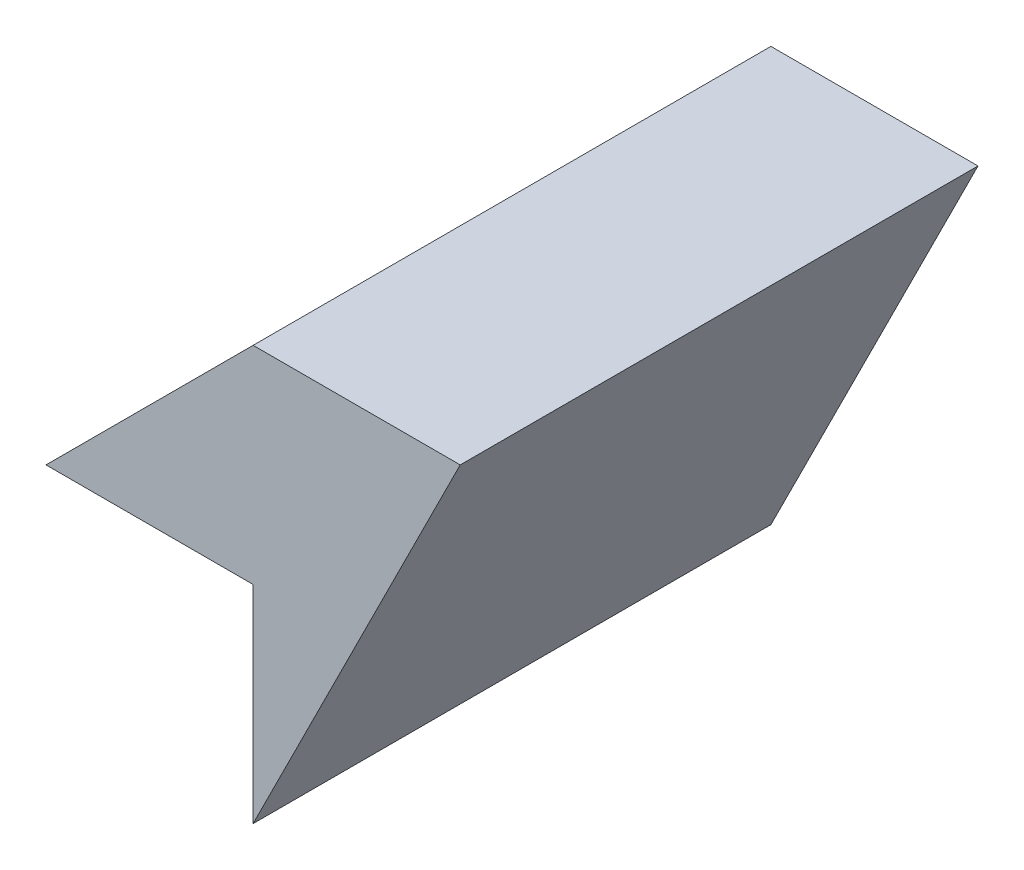
ISO-10303-21;
HEADER;
FILE_DESCRIPTION(('STEP AP214'),'2;1');
FILE_NAME('part.step','',(''),(''),'','','');
FILE_SCHEMA(('AUTOMOTIVE_DESIGN { 1 0 10303 214 1 1 1 1 }'));
ENDSEC;
DATA;
#1=APPLICATION_CONTEXT('core data for automotive mechanical design processes');
#2=APPLICATION_PROTOCOL_DEFINITION('international standard','automotive_design',2000,#1);
#3=PRODUCT_CONTEXT('',#1,'mechanical');
#4=PRODUCT('Part','Part','',(#3));
#5=PRODUCT_RELATED_PRODUCT_CATEGORY('part','',(#4));
#6=PRODUCT_DEFINITION_FORMATION('','',#4);
#7=PRODUCT_DEFINITION_CONTEXT('part definition',#1,'design');
#8=PRODUCT_DEFINITION('design','',#6,#7);
#9=PRODUCT_DEFINITION_SHAPE('','',#8);
#10=(LENGTH_UNIT() NAMED_UNIT(*) SI_UNIT(.MILLI.,.METRE.));
#11=(NAMED_UNIT(*) PLANE_ANGLE_UNIT() SI_UNIT($,.RADIAN.));
#12=(NAMED_UNIT(*) SI_UNIT($,.STERADIAN.) SOLID_ANGLE_UNIT());
#13=UNCERTAINTY_MEASURE_WITH_UNIT(LENGTH_MEASURE(1.E-05),#10,'distance_accuracy_value','');
#14=(GEOMETRIC_REPRESENTATION_CONTEXT(3) GLOBAL_UNCERTAINTY_ASSIGNED_CONTEXT((#13)) GLOBAL_UNIT_ASSIGNED_CONTEXT((#10,
#11,#12)) REPRESENTATION_CONTEXT('',''));
#15=CARTESIAN_POINT('',(0.,0.,0.));
#16=DIRECTION('',(0.,0.,1.));
#17=DIRECTION('',(1.,0.,0.));
#18=AXIS2_PLACEMENT_3D('',#15,#16,#17);
#19=CARTESIAN_POINT('',(-10.,-10.,25.));
#20=DIRECTION('',(0.,1.,0.));
#21=DIRECTION('',(-1.,0.,0.));
#22=AXIS2_PLACEMENT_3D('',#19,#20,#21);
#23=PLANE('',#22);
#24=DIRECTION('',(1.,0.,0.));
#25=VECTOR('',#24,1.);
#26=CARTESIAN_POINT('',(-10.,-10.,0.));
#27=LINE('',#26,#25);
#28=CARTESIAN_POINT('',(-20.,-10.,0.));
#29=VERTEX_POINT('',#28);
#30=CARTESIAN_POINT('',(-10.,-10.,0.));
#31=VERTEX_POINT('',#30);
#32=EDGE_CURVE('E107',#29,#31,#27,.T.);
#33=ORIENTED_EDGE('',*,*,#32,.T.);
#34=DIRECTION('',(0.,0.,-1.));
#35=VECTOR('',#34,1.);
#36=CARTESIAN_POINT('',(-10.,-10.,25.));
#37=LINE('',#36,#35);
#38=CARTESIAN_POINT('',(-10.,-10.,25.));
#39=VERTEX_POINT('',#38);
#40=EDGE_CURVE('E11',#39,#31,#37,.T.);
#41=ORIENTED_EDGE('',*,*,#40,.F.);
#42=DIRECTION('',(1.,0.,0.));
#43=VECTOR('',#42,1.);
#44=CARTESIAN_POINT('',(-10.,-10.,25.));
#45=LINE('',#44,#43);
#46=CARTESIAN_POINT('',(-20.,-10.,25.));
#47=VERTEX_POINT('',#46);
#48=EDGE_CURVE('E115',#47,#39,#45,.T.);
#49=ORIENTED_EDGE('',*,*,#48,.F.);
#50=DIRECTION('',(0.,0.,-1.));
#51=VECTOR('',#50,1.);
#52=CARTESIAN_POINT('',(-20.,-10.,25.));
#53=LINE('',#52,#51);
#54=EDGE_CURVE('E103',#47,#29,#53,.T.);
#55=ORIENTED_EDGE('',*,*,#54,.T.);
#56=EDGE_LOOP('',(#33,#41,#49,#55));
#57=FACE_BOUND('',#56,.T.);
#58=ADVANCED_FACE('F33',(#57),#23,.F.);
#59=CARTESIAN_POINT('',(-10.,-20.,25.));
#60=DIRECTION('',(1.,0.,0.));
#61=DIRECTION('',(0.,0.,-1.));
#62=AXIS2_PLACEMENT_3D('',#59,#60,#61);
#63=PLANE('',#62);
#64=DIRECTION('',(0.,-1.,0.));
#65=VECTOR('',#64,1.);
#66=CARTESIAN_POINT('',(-10.,-20.,0.));
#67=LINE('',#66,#65);
#68=CARTESIAN_POINT('',(-10.,-20.,0.));
#69=VERTEX_POINT('',#68);
#70=EDGE_CURVE('E110',#31,#69,#67,.T.);
#71=ORIENTED_EDGE('',*,*,#70,.T.);
#72=DIRECTION('',(0.,0.,-1.));
#73=VECTOR('',#72,1.);
#74=CARTESIAN_POINT('',(-10.,-20.,25.));
#75=LINE('',#74,#73);
#76=CARTESIAN_POINT('',(-10.,-20.,25.));
#77=VERTEX_POINT('',#76);
#78=EDGE_CURVE('E41',#77,#69,#75,.T.);
#79=ORIENTED_EDGE('',*,*,#78,.F.);
#80=DIRECTION('',(0.,-1.,0.));
#81=VECTOR('',#80,1.);
#82=CARTESIAN_POINT('',(-10.,-20.,25.));
#83=LINE('',#82,#81);
#84=EDGE_CURVE('E83',#39,#77,#83,.T.);
#85=ORIENTED_EDGE('',*,*,#84,.F.);
#86=ORIENTED_EDGE('',*,*,#40,.T.);
#87=EDGE_LOOP('',(#71,#79,#85,#86));
#88=FACE_BOUND('',#87,.T.);
#89=ADVANCED_FACE('F134',(#88),#63,.F.);
#90=CARTESIAN_POINT('',(0.,0.,25.));
#91=DIRECTION('',(-0.894427190999916,0.447213595499958,0.));
#92=DIRECTION('',(-0.447213595499958,-0.894427190999916,0.));
#93=AXIS2_PLACEMENT_3D('',#90,#91,#92);
#94=PLANE('',#93);
#95=DIRECTION('',(0.447213595499958,0.894427190999916,0.));
#96=VECTOR('',#95,1.);
#97=CARTESIAN_POINT('',(0.,0.,0.));
#98=LINE('',#97,#96);
#99=CARTESIAN_POINT('',(0.,0.,0.));
#100=VERTEX_POINT('',#99);
#101=EDGE_CURVE('E98',#69,#100,#98,.T.);
#102=ORIENTED_EDGE('',*,*,#101,.T.);
#103=DIRECTION('',(0.,0.,-1.));
#104=VECTOR('',#103,1.);
#105=CARTESIAN_POINT('',(0.,0.,25.));
#106=LINE('',#105,#104);
#107=CARTESIAN_POINT('',(0.,0.,25.));
#108=VERTEX_POINT('',#107);
#109=EDGE_CURVE('E95',#108,#100,#106,.T.);
#110=ORIENTED_EDGE('',*,*,#109,.F.);
#111=DIRECTION('',(0.447213595499958,0.894427190999916,0.));
#112=VECTOR('',#111,1.);
#113=CARTESIAN_POINT('',(0.,0.,25.));
#114=LINE('',#113,#112);
#115=EDGE_CURVE('E87',#77,#108,#114,.T.);
#116=ORIENTED_EDGE('',*,*,#115,.F.);
#117=ORIENTED_EDGE('',*,*,#78,.T.);
#118=EDGE_LOOP('',(#102,#110,#116,#117));
#119=FACE_BOUND('',#118,.T.);
#120=ADVANCED_FACE('F96',(#119),#94,.F.);
#121=CARTESIAN_POINT('',(-10.,0.,25.));
#122=DIRECTION('',(0.,-1.,0.));
#123=DIRECTION('',(0.,0.,-1.));
#124=AXIS2_PLACEMENT_3D('',#121,#122,#123);
#125=PLANE('',#124);
#126=DIRECTION('',(-1.,0.,0.));
#127=VECTOR('',#126,1.);
#128=CARTESIAN_POINT('',(-10.,0.,0.));
#129=LINE('',#128,#127);
#130=CARTESIAN_POINT('',(-10.,0.,0.));
#131=VERTEX_POINT('',#130);
#132=EDGE_CURVE('E69',#100,#131,#129,.T.);
#133=ORIENTED_EDGE('',*,*,#132,.T.);
#134=DIRECTION('',(0.,0.,-1.));
#135=VECTOR('',#134,1.);
#136=CARTESIAN_POINT('',(-10.,0.,25.));
#137=LINE('',#136,#135);
#138=CARTESIAN_POINT('',(-10.,0.,25.));
#139=VERTEX_POINT('',#138);
#140=EDGE_CURVE('E99',#139,#131,#137,.T.);
#141=ORIENTED_EDGE('',*,*,#140,.F.);
#142=DIRECTION('',(-1.,0.,0.));
#143=VECTOR('',#142,1.);
#144=CARTESIAN_POINT('',(-10.,0.,25.));
#145=LINE('',#144,#143);
#146=EDGE_CURVE('E91',#108,#139,#145,.T.);
#147=ORIENTED_EDGE('',*,*,#146,.F.);
#148=ORIENTED_EDGE('',*,*,#109,.T.);
#149=EDGE_LOOP('',(#133,#141,#147,#148));
#150=FACE_BOUND('',#149,.T.);
#151=ADVANCED_FACE('F101',(#150),#125,.F.);
#152=CARTESIAN_POINT('',(-20.,-10.,25.));
#153=DIRECTION('',(0.707106781186548,-0.707106781186548,0.));
#154=DIRECTION('',(0.707106781186548,0.707106781186548,0.));
#155=AXIS2_PLACEMENT_3D('',#152,#153,#154);
#156=PLANE('',#155);
#157=DIRECTION('',(-0.707106781186548,-0.707106781186548,0.));
#158=VECTOR('',#157,1.);
#159=CARTESIAN_POINT('',(-20.,-10.,0.));
#160=LINE('',#159,#158);
#161=EDGE_CURVE('E75',#131,#29,#160,.T.);
#162=ORIENTED_EDGE('',*,*,#161,.T.);
#163=ORIENTED_EDGE('',*,*,#54,.F.);
#164=DIRECTION('',(-0.707106781186548,-0.707106781186548,0.));
#165=VECTOR('',#164,1.);
#166=CARTESIAN_POINT('',(-20.,-10.,25.));
#167=LINE('',#166,#165);
#168=EDGE_CURVE('E49',#139,#47,#167,.T.);
#169=ORIENTED_EDGE('',*,*,#168,.F.);
#170=ORIENTED_EDGE('',*,*,#140,.T.);
#171=EDGE_LOOP('',(#162,#163,#169,#170));
#172=FACE_BOUND('',#171,.T.);
#173=ADVANCED_FACE('F123',(#172),#156,.F.);
#174=CARTESIAN_POINT('',(0.,0.,25.));
#175=DIRECTION('',(0.,0.,-1.));
#176=DIRECTION('',(-1.,0.,0.));
#177=AXIS2_PLACEMENT_3D('',#174,#175,#176);
#178=PLANE('',#177);
#179=ORIENTED_EDGE('',*,*,#48,.T.);
#180=ORIENTED_EDGE('',*,*,#84,.T.);
#181=ORIENTED_EDGE('',*,*,#115,.T.);
#182=ORIENTED_EDGE('',*,*,#146,.T.);
#183=ORIENTED_EDGE('',*,*,#168,.T.);
#184=EDGE_LOOP('',(#179,#180,#181,#182,#183));
#185=FACE_BOUND('',#184,.T.);
#186=ADVANCED_FACE('F89',(#185),#178,.F.);
#187=CARTESIAN_POINT('',(0.,0.,0.));
#188=DIRECTION('',(0.,0.,-1.));
#189=DIRECTION('',(-1.,0.,0.));
#190=AXIS2_PLACEMENT_3D('',#187,#188,#189);
#191=PLANE('',#190);
#192=ORIENTED_EDGE('',*,*,#32,.F.);
#193=ORIENTED_EDGE('',*,*,#161,.F.);
#194=ORIENTED_EDGE('',*,*,#132,.F.);
#195=ORIENTED_EDGE('',*,*,#101,.F.);
#196=ORIENTED_EDGE('',*,*,#70,.F.);
#197=EDGE_LOOP('',(#192,#193,#194,#195,#196));
#198=FACE_BOUND('',#197,.T.);
#199=ADVANCED_FACE('F119',(#198),#191,.T.);
#200=CLOSED_SHELL('',(#58,#89,#120,#151,#173,#186,#199));
#201=MANIFOLD_SOLID_BREP('B2',#200);
#202=ADVANCED_BREP_SHAPE_REPRESENTATION('',(#18,#201),#14);
#203=SHAPE_DEFINITION_REPRESENTATION(#9,#202);
ENDSEC;
END-ISO-10303-21;
